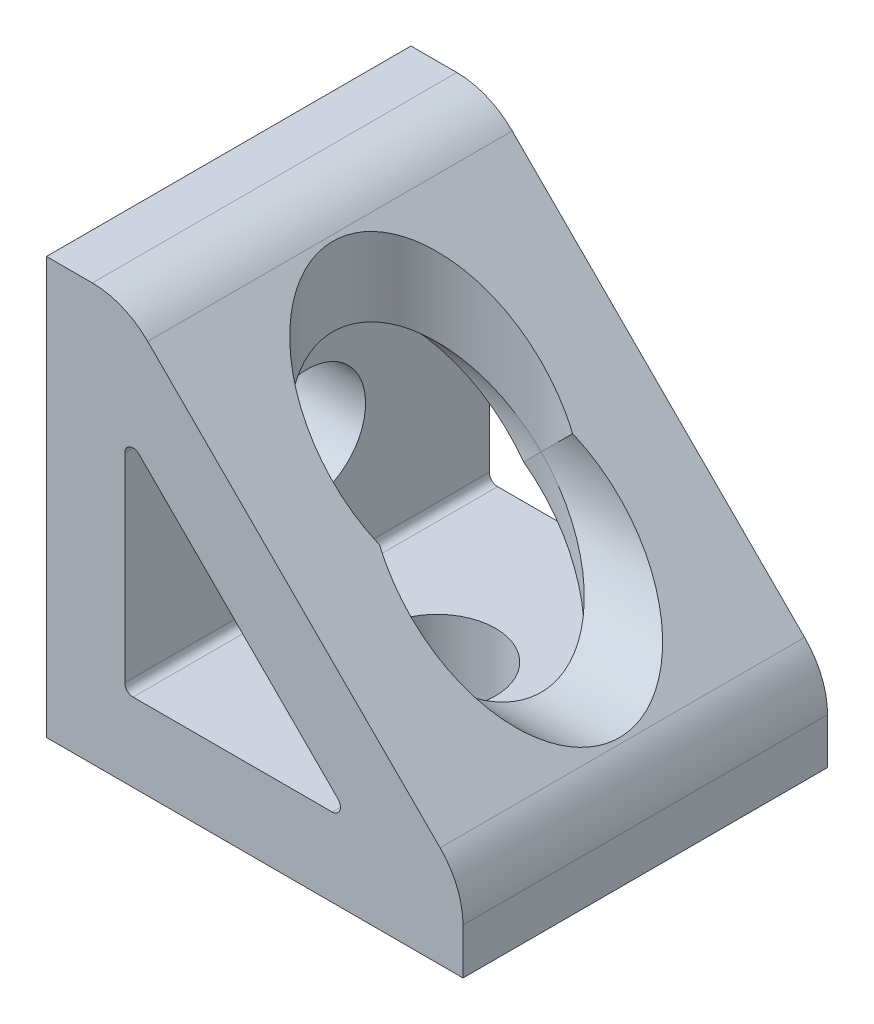
ISO-10303-21;
HEADER;
FILE_DESCRIPTION(('STEP AP214'),'2;1');
FILE_NAME('part.step','',(''),(''),'','','');
FILE_SCHEMA(('AUTOMOTIVE_DESIGN { 1 0 10303 214 1 1 1 1 }'));
ENDSEC;
DATA;
#1=APPLICATION_CONTEXT('core data for automotive mechanical design processes');
#2=APPLICATION_PROTOCOL_DEFINITION('international standard','automotive_design',2000,#1);
#3=PRODUCT_CONTEXT('',#1,'mechanical');
#4=PRODUCT('Part','Part','',(#3));
#5=PRODUCT_RELATED_PRODUCT_CATEGORY('part','',(#4));
#6=PRODUCT_DEFINITION_FORMATION('','',#4);
#7=PRODUCT_DEFINITION_CONTEXT('part definition',#1,'design');
#8=PRODUCT_DEFINITION('design','',#6,#7);
#9=PRODUCT_DEFINITION_SHAPE('','',#8);
#10=(LENGTH_UNIT() NAMED_UNIT(*) SI_UNIT(.MILLI.,.METRE.));
#11=(NAMED_UNIT(*) PLANE_ANGLE_UNIT() SI_UNIT($,.RADIAN.));
#12=(NAMED_UNIT(*) SI_UNIT($,.STERADIAN.) SOLID_ANGLE_UNIT());
#13=UNCERTAINTY_MEASURE_WITH_UNIT(LENGTH_MEASURE(1.E-05),#10,'distance_accuracy_value','');
#14=(GEOMETRIC_REPRESENTATION_CONTEXT(3) GLOBAL_UNCERTAINTY_ASSIGNED_CONTEXT((#13)) GLOBAL_UNIT_ASSIGNED_CONTEXT((#10,
#11,#12)) REPRESENTATION_CONTEXT('',''));
#15=CARTESIAN_POINT('',(0.,0.,0.));
#16=DIRECTION('',(0.,0.,1.));
#17=DIRECTION('',(1.,0.,0.));
#18=AXIS2_PLACEMENT_3D('',#15,#16,#17);
#19=CARTESIAN_POINT('',(12.7,25.4,0.));
#20=DIRECTION('',(0.,-1.,0.));
#21=DIRECTION('',(0.,0.,-1.));
#22=AXIS2_PLACEMENT_3D('',#19,#20,#21);
#23=CYLINDRICAL_SURFACE('',#22,6.35);
#24=CARTESIAN_POINT('',(12.7,17.4752,0.));
#25=DIRECTION('',(-0.707106781186548,-0.707106781186548,0.));
#26=DIRECTION('',(0.707106781186548,-0.707106781186548,0.));
#27=AXIS2_PLACEMENT_3D('',#24,#25,#26);
#28=ELLIPSE('',#27,8.98025612106915,6.35);
#29=CARTESIAN_POINT('',(15.0876,15.0876,-5.88403486053576));
#30=VERTEX_POINT('',#29);
#31=CARTESIAN_POINT('',(15.0876,15.0876,5.88403486053576));
#32=VERTEX_POINT('',#31);
#33=EDGE_CURVE('E384',#30,#32,#28,.F.);
#34=ORIENTED_EDGE('',*,*,#33,.T.);
#35=CARTESIAN_POINT('',(12.7,12.7,0.));
#36=DIRECTION('',(0.707106781186548,-0.707106781186547,0.));
#37=DIRECTION('',(-0.707106781186547,-0.707106781186548,0.));
#38=AXIS2_PLACEMENT_3D('',#35,#36,#37);
#39=ELLIPSE('',#38,8.98025612106915,6.35);
#40=CARTESIAN_POINT('',(12.7,12.7,6.35));
#41=VERTEX_POINT('',#40);
#42=EDGE_CURVE('E182',#32,#41,#39,.T.);
#43=ORIENTED_EDGE('',*,*,#42,.T.);
#44=CARTESIAN_POINT('',(12.7,12.7,0.));
#45=DIRECTION('',(-0.707106781186547,-0.707106781186548,0.));
#46=DIRECTION('',(0.707106781186548,-0.707106781186547,0.));
#47=AXIS2_PLACEMENT_3D('',#44,#45,#46);
#48=ELLIPSE('',#47,8.98025612106915,6.35);
#49=CARTESIAN_POINT('',(12.7,12.7,-6.35));
#50=VERTEX_POINT('',#49);
#51=EDGE_CURVE('E168',#41,#50,#48,.T.);
#52=ORIENTED_EDGE('',*,*,#51,.T.);
#53=CARTESIAN_POINT('',(12.7,12.7,0.));
#54=DIRECTION('',(-0.707106781186548,0.707106781186547,0.));
#55=DIRECTION('',(-0.707106781186547,-0.707106781186548,0.));
#56=AXIS2_PLACEMENT_3D('',#53,#54,#55);
#57=ELLIPSE('',#56,8.98025612106915,6.35);
#58=EDGE_CURVE('E174',#30,#50,#57,.T.);
#59=ORIENTED_EDGE('',*,*,#58,.F.);
#60=EDGE_LOOP('',(#34,#43,#52,#59));
#61=FACE_BOUND('',#60,.T.);
#62=ADVANCED_FACE('F17',(#61),#23,.F.);
#63=CARTESIAN_POINT('',(25.4,12.7,0.));
#64=DIRECTION('',(-1.,0.,0.));
#65=DIRECTION('',(0.,-1.,0.));
#66=AXIS2_PLACEMENT_3D('',#63,#64,#65);
#67=CYLINDRICAL_SURFACE('',#66,6.35);
#68=CARTESIAN_POINT('',(17.4752,12.7,0.));
#69=DIRECTION('',(-0.707106781186548,-0.707106781186548,0.));
#70=DIRECTION('',(-0.707106781186548,0.707106781186548,0.));
#71=AXIS2_PLACEMENT_3D('',#68,#69,#70);
#72=ELLIPSE('',#71,8.98025612106915,6.35);
#73=EDGE_CURVE('E177',#32,#30,#72,.F.);
#74=ORIENTED_EDGE('',*,*,#73,.T.);
#75=ORIENTED_EDGE('',*,*,#58,.T.);
#76=CARTESIAN_POINT('',(12.7,12.7,0.));
#77=DIRECTION('',(-0.707106781186547,-0.707106781186548,0.));
#78=DIRECTION('',(-0.707106781186548,0.707106781186547,0.));
#79=AXIS2_PLACEMENT_3D('',#76,#77,#78);
#80=ELLIPSE('',#79,8.98025612106915,6.35);
#81=EDGE_CURVE('E151',#50,#41,#80,.T.);
#82=ORIENTED_EDGE('',*,*,#81,.T.);
#83=ORIENTED_EDGE('',*,*,#42,.F.);
#84=EDGE_LOOP('',(#74,#75,#82,#83));
#85=FACE_BOUND('',#84,.T.);
#86=ADVANCED_FACE('F175',(#85),#67,.F.);
#87=CARTESIAN_POINT('',(17.4204269072705,5.2832,11.1125));
#88=DIRECTION('',(0.,0.,-1.));
#89=DIRECTION('',(-1.,0.,0.));
#90=AXIS2_PLACEMENT_3D('',#87,#88,#89);
#91=CYLINDRICAL_SURFACE('',#90,0.507999999999998);
#92=CARTESIAN_POINT('',(17.7796371521132,5.64241024484277,3.81048374919394));
#93=CARTESIAN_POINT('',(17.7883333124472,5.63370856311354,3.79889138080289));
#94=CARTESIAN_POINT('',(17.7968318828416,5.62458349521479,3.78747906709042));
#95=CARTESIAN_POINT('',(17.8133986981704,5.60537916131748,3.76508284849013));
#96=CARTESIAN_POINT('',(17.8214656298365,5.59529721644453,3.75410027562521));
#97=CARTESIAN_POINT('',(17.845116428317,5.56322842926829,3.72169206560348));
#98=CARTESIAN_POINT('',(17.8598958230457,5.53966448295931,3.70114636974854));
#99=CARTESIAN_POINT('',(17.8810924886656,5.49805620283357,3.67137249799756));
#100=CARTESIAN_POINT('',(17.8885219657932,5.48144766364685,3.66085708987994));
#101=CARTESIAN_POINT('',(17.9018070766133,5.44654991824729,3.64195486288475));
#102=CARTESIAN_POINT('',(17.9076700681061,5.42826913070793,3.63355810342968));
#103=CARTESIAN_POINT('',(17.9166075365671,5.39336530960493,3.62071223652807));
#104=CARTESIAN_POINT('',(17.9199849010382,5.37697915115832,3.61583705936111));
#105=CARTESIAN_POINT('',(17.9251279628338,5.34343306471349,3.60840111990062));
#106=CARTESIAN_POINT('',(17.9268941679798,5.3262733823132,3.60583962835855));
#107=CARTESIAN_POINT('',(17.9286548266346,5.29160179665178,3.60328620101482));
#108=CARTESIAN_POINT('',(17.9286425196726,5.27408880245012,3.60330406986407));
#109=CARTESIAN_POINT('',(17.9268301762173,5.23935342325999,3.60593241684237));
#110=CARTESIAN_POINT('',(17.9250295700926,5.22213113264778,3.60854372106509));
#111=CARTESIAN_POINT('',(17.9199552088587,5.18942107284772,3.61587965499263));
#112=CARTESIAN_POINT('',(17.9167695871463,5.17389017844441,3.62047776327796));
#113=CARTESIAN_POINT('',(17.9091675862811,5.14377949301812,3.63140709900997));
#114=CARTESIAN_POINT('',(17.9047507311679,5.12920007250359,3.63773899667438));
#115=CARTESIAN_POINT('',(17.8918125900947,5.09229033092581,3.65619671030874));
#116=CARTESIAN_POINT('',(17.8824535417514,5.07082680530542,3.66946707518853));
#117=CARTESIAN_POINT('',(17.8617960798292,5.03067317538378,3.69847020640858));
#118=CARTESIAN_POINT('',(17.8504919154002,5.01199161069783,3.71421026201154));
#119=CARTESIAN_POINT('',(17.8191201500256,4.96654401619267,3.75741714079145));
#120=CARTESIAN_POINT('',(17.7979147534765,4.94180261343145,3.78617800705458));
#121=CARTESIAN_POINT('',(17.753003271266,4.89791670491141,3.84591628870004));
#122=CARTESIAN_POINT('',(17.7292906766661,4.87878727910359,3.87689940277821));
#123=CARTESIAN_POINT('',(17.6686922203378,4.83787692204293,3.95449037561444));
#124=CARTESIAN_POINT('',(17.630748506309,4.81889679757743,4.00175305373392));
#125=CARTESIAN_POINT('',(17.5521217993657,4.79080014757748,4.09673128578227));
#126=CARTESIAN_POINT('',(17.5114440480836,4.78166528938716,4.14444583051086));
#127=CARTESIAN_POINT('',(17.4535207465419,4.77601780812482,4.210364646228));
#128=CARTESIAN_POINT('',(17.4370271200594,4.77520995303944,4.22891486166735));
#129=CARTESIAN_POINT('',(17.4204269072705,4.7752,4.24736033473935));
#130=B_SPLINE_CURVE_WITH_KNOTS('',3,(#92,#93,#94,#95,#96,#97,#98,#99,#100,#101,#102,#103,#104,
#105,#106,#107,#108,#109,#110,#111,#112,#113,#114,#115,#116,#117,#118,#119,#120,#121,#122,#123,
#124,#125,#126,#127,#128,#129),.UNSPECIFIED.,.F.,.F.,(4,2,2,2,2,2,2,2,2,2,2,2,2,2,2,2,2,2,4),
(0.,0.0506837306520263,0.101513794219076,0.204635683435221,0.267505038050829,0.330073685533628,
0.382138884926963,0.434187668203855,0.486434304227522,0.538697587846183,0.588034428624639,
0.637390368159527,0.717669114407369,0.798189421008752,0.927853058393364,1.05786198911492,
1.24743713587404,1.43665866572774,1.51111326173056),.UNSPECIFIED.);
#131=CARTESIAN_POINT('',(17.7796371521132,5.64241024484277,3.81048374919394));
#132=VERTEX_POINT('',#131);
#133=CARTESIAN_POINT('',(17.4204269072705,4.7752,4.24736033473935));
#134=VERTEX_POINT('',#133);
#135=EDGE_CURVE('E163',#132,#134,#130,.T.);
#136=ORIENTED_EDGE('',*,*,#135,.T.);
#137=DIRECTION('',(0.,0.,1.));
#138=VECTOR('',#137,1.);
#139=CARTESIAN_POINT('',(17.4204269072705,4.7752,11.1125));
#140=LINE('',#139,#138);
#141=CARTESIAN_POINT('',(17.4204269072705,4.7752,11.1125));
#142=VERTEX_POINT('',#141);
#143=EDGE_CURVE('E380',#142,#134,#140,.F.);
#144=ORIENTED_EDGE('',*,*,#143,.F.);
#145=CARTESIAN_POINT('',(17.4204269072705,5.2832,11.1125));
#146=DIRECTION('',(0.,0.,-1.));
#147=DIRECTION('',(-1.,0.,0.));
#148=AXIS2_PLACEMENT_3D('',#145,#146,#147);
#149=CIRCLE('',#148,0.507999999999998);
#150=CARTESIAN_POINT('',(17.7796371521132,5.64241024484277,11.1125));
#151=VERTEX_POINT('',#150);
#152=EDGE_CURVE('E503',#151,#142,#149,.T.);
#153=ORIENTED_EDGE('',*,*,#152,.F.);
#154=DIRECTION('',(0.,0.,1.));
#155=VECTOR('',#154,1.);
#156=CARTESIAN_POINT('',(17.7796371521132,5.64241024484277,11.1125));
#157=LINE('',#156,#155);
#158=EDGE_CURVE('E390',#132,#151,#157,.T.);
#159=ORIENTED_EDGE('',*,*,#158,.F.);
#160=EDGE_LOOP('',(#136,#144,#153,#159));
#161=FACE_BOUND('',#160,.T.);
#162=ADVANCED_FACE('F527',(#161),#91,.F.);
#163=CARTESIAN_POINT('',(5.2832,17.4204269072705,11.1125));
#164=DIRECTION('',(0.,0.,-1.));
#165=DIRECTION('',(-1.,0.,0.));
#166=AXIS2_PLACEMENT_3D('',#163,#164,#165);
#167=CYLINDRICAL_SURFACE('',#166,0.508);
#168=CARTESIAN_POINT('',(4.7752,17.4204269072704,4.24736033473935));
#169=CARTESIAN_POINT('',(4.77521046724601,17.4420924856764,4.22328508045935));
#170=CARTESIAN_POINT('',(4.77658605471394,17.4635662308095,4.19904582709387));
#171=CARTESIAN_POINT('',(4.78200159472634,17.5060131520486,4.15039429932005));
#172=CARTESIAN_POINT('',(4.78604351709437,17.5269859461851,4.12598191020381));
#173=CARTESIAN_POINT('',(4.79678199208576,17.5684994852333,4.07691772352855));
#174=CARTESIAN_POINT('',(4.80350610470041,17.5890333365038,4.05226611774794));
#175=CARTESIAN_POINT('',(4.81961765940842,17.6292935812707,4.00319516862432));
#176=CARTESIAN_POINT('',(4.82900389569489,17.6490203357225,3.97877572528728));
#177=CARTESIAN_POINT('',(4.85455357115968,17.6947394093427,3.92133656460339));
#178=CARTESIAN_POINT('',(4.87193874939082,17.7203148602738,3.88851705199913));
#179=CARTESIAN_POINT('',(4.91237240067932,17.7690703949101,3.82473811417215));
#180=CARTESIAN_POINT('',(4.9354004825951,17.7922586856149,3.79377248031576));
#181=CARTESIAN_POINT('',(4.97791824667546,17.8270004785444,3.74658101072067));
#182=CARTESIAN_POINT('',(4.99535181365528,17.8395940700084,3.72927348245638));
#183=CARTESIAN_POINT('',(5.03302106404657,17.863108232783,3.69664903722876));
#184=CARTESIAN_POINT('',(5.05325324857269,17.8740308578064,3.68132968026151));
#185=CARTESIAN_POINT('',(5.09114655378691,17.8910574220427,3.65726436442134));
#186=CARTESIAN_POINT('',(5.10813847665273,17.8976789749363,3.64783982251966));
#187=CARTESIAN_POINT('',(5.14373439367388,17.9092642191962,3.63127642560542));
#188=CARTESIAN_POINT('',(5.16233579994144,17.9142305118781,3.62413398490661));
#189=CARTESIAN_POINT('',(5.19743703216341,17.9213962914119,3.61380042328051));
#190=CARTESIAN_POINT('',(5.21372677322737,17.9239297564496,3.61013390639403));
#191=CARTESIAN_POINT('',(5.24682501316101,17.9273953129222,3.60511413516427));
#192=CARTESIAN_POINT('',(5.26363309486034,17.9283286596024,3.6037590675622));
#193=CARTESIAN_POINT('',(5.29730447707779,17.9285104709857,3.60349529156194));
#194=CARTESIAN_POINT('',(5.31416782281174,17.927756317429,3.60459038473776));
#195=CARTESIAN_POINT('',(5.3474214082833,17.9246285205018,3.60912233530311));
#196=CARTESIAN_POINT('',(5.36381132370793,17.9222537931886,3.61256076005944));
#197=CARTESIAN_POINT('',(5.39943025782155,17.9153565231575,3.62251299486325));
#198=CARTESIAN_POINT('',(5.41843841204279,17.9104640845815,3.62955440383875));
#199=CARTESIAN_POINT('',(5.4548178207322,17.89894290879,3.64603808381968));
#200=CARTESIAN_POINT('',(5.47218546922247,17.892310462367,3.65548548244433));
#201=CARTESIAN_POINT('',(5.51333857652347,17.8741082748739,3.68123036161128));
#202=CARTESIAN_POINT('',(5.53607437061717,17.8617153299734,3.69861048602099));
#203=CARTESIAN_POINT('',(5.57802257558475,17.834874461339,3.7357851633193));
#204=CARTESIAN_POINT('',(5.59723052062932,17.8204239735057,3.75558272435373));
#205=CARTESIAN_POINT('',(5.62450634899135,17.7969006642059,3.78738763194976));
#206=CARTESIAN_POINT('',(5.63367579047622,17.7883611270019,3.79885605078555));
#207=CARTESIAN_POINT('',(5.64241024484278,17.7796371521132,3.81048374919394));
#208=B_SPLINE_CURVE_WITH_KNOTS('',3,(#168,#169,#170,#171,#172,#173,#174,#175,#176,#177,#178,
#179,#180,#181,#182,#183,#184,#185,#186,#187,#188,#189,#190,#191,#192,#193,#194,#195,#196,#197,
#198,#199,#200,#201,#202,#203,#204,#205,#206,#207),.UNSPECIFIED.,.F.,.F.,(4,2,2,2,2,2,2,2,2,2,2,
2,2,2,2,2,2,2,2,4),(0.,0.0971267833027569,0.194325401998055,0.292549599213744,0.390729376712899,
0.525638679797282,0.66006748478254,0.742693286989565,0.825216707102879,0.886598734818593,
0.947883838018685,0.998331037145106,1.0487386438098,1.09922451518082,1.14974418784643,
1.21195644571509,1.27430241571198,1.36734096694783,1.46049649396306,1.511404348917),.UNSPECIFIED.);
#209=CARTESIAN_POINT('',(4.7752,17.4204269072704,4.24736033473935));
#210=VERTEX_POINT('',#209);
#211=CARTESIAN_POINT('',(5.64241024484278,17.7796371521132,3.81048374919394));
#212=VERTEX_POINT('',#211);
#213=EDGE_CURVE('E162',#210,#212,#208,.T.);
#214=ORIENTED_EDGE('',*,*,#213,.T.);
#215=DIRECTION('',(0.,0.,1.));
#216=VECTOR('',#215,1.);
#217=CARTESIAN_POINT('',(5.64241024484278,17.7796371521132,11.1125));
#218=LINE('',#217,#216);
#219=CARTESIAN_POINT('',(5.64241024484277,17.7796371521132,11.1125));
#220=VERTEX_POINT('',#219);
#221=EDGE_CURVE('E233',#220,#212,#218,.F.);
#222=ORIENTED_EDGE('',*,*,#221,.F.);
#223=CARTESIAN_POINT('',(5.2832,17.4204269072705,11.1125));
#224=DIRECTION('',(0.,0.,-1.));
#225=DIRECTION('',(-1.,0.,0.));
#226=AXIS2_PLACEMENT_3D('',#223,#224,#225);
#227=CIRCLE('',#226,0.508);
#228=CARTESIAN_POINT('',(4.7752,17.4204269072705,11.1125));
#229=VERTEX_POINT('',#228);
#230=EDGE_CURVE('E500',#229,#220,#227,.T.);
#231=ORIENTED_EDGE('',*,*,#230,.F.);
#232=DIRECTION('',(0.,0.,1.));
#233=VECTOR('',#232,1.);
#234=CARTESIAN_POINT('',(4.7752,17.4204269072704,11.1125));
#235=LINE('',#234,#233);
#236=EDGE_CURVE('E374',#210,#229,#235,.T.);
#237=ORIENTED_EDGE('',*,*,#236,.F.);
#238=EDGE_LOOP('',(#214,#222,#231,#237));
#239=FACE_BOUND('',#238,.T.);
#240=ADVANCED_FACE('F203',(#239),#167,.F.);
#241=CARTESIAN_POINT('',(5.2832,5.2832,11.1125));
#242=DIRECTION('',(0.,0.,-1.));
#243=DIRECTION('',(-1.,0.,0.));
#244=AXIS2_PLACEMENT_3D('',#241,#242,#243);
#245=CYLINDRICAL_SURFACE('',#244,0.508);
#246=DIRECTION('',(0.,0.,1.));
#247=VECTOR('',#246,1.);
#248=CARTESIAN_POINT('',(4.7752,5.2832,11.1125));
#249=LINE('',#248,#247);
#250=CARTESIAN_POINT('',(4.7752,5.2832,11.1125));
#251=VERTEX_POINT('',#250);
#252=CARTESIAN_POINT('',(4.7752,5.2832,-11.1125));
#253=VERTEX_POINT('',#252);
#254=EDGE_CURVE('E369',#251,#253,#249,.F.);
#255=ORIENTED_EDGE('',*,*,#254,.F.);
#256=CARTESIAN_POINT('',(5.2832,5.2832,11.1125));
#257=DIRECTION('',(0.,0.,-1.));
#258=DIRECTION('',(-1.,0.,0.));
#259=AXIS2_PLACEMENT_3D('',#256,#257,#258);
#260=CIRCLE('',#259,0.508);
#261=CARTESIAN_POINT('',(5.2832,4.7752,11.1125));
#262=VERTEX_POINT('',#261);
#263=EDGE_CURVE('E502',#262,#251,#260,.T.);
#264=ORIENTED_EDGE('',*,*,#263,.F.);
#265=DIRECTION('',(0.,0.,1.));
#266=VECTOR('',#265,1.);
#267=CARTESIAN_POINT('',(5.28320000000001,4.7752,11.1125));
#268=LINE('',#267,#266);
#269=CARTESIAN_POINT('',(5.2832,4.7752,-11.1125));
#270=VERTEX_POINT('',#269);
#271=EDGE_CURVE('E433',#270,#262,#268,.T.);
#272=ORIENTED_EDGE('',*,*,#271,.F.);
#273=CARTESIAN_POINT('',(5.2832,5.2832,-11.1125));
#274=DIRECTION('',(0.,0.,-1.));
#275=DIRECTION('',(-1.,0.,0.));
#276=AXIS2_PLACEMENT_3D('',#273,#274,#275);
#277=CIRCLE('',#276,0.508);
#278=EDGE_CURVE('E494',#253,#270,#277,.F.);
#279=ORIENTED_EDGE('',*,*,#278,.F.);
#280=EDGE_LOOP('',(#255,#264,#272,#279));
#281=FACE_BOUND('',#280,.T.);
#282=ADVANCED_FACE('F616',(#281),#245,.F.);
#283=CARTESIAN_POINT('',(12.7,25.4,0.));
#284=DIRECTION('',(0.,-1.,0.));
#285=DIRECTION('',(0.,0.,-1.));
#286=AXIS2_PLACEMENT_3D('',#283,#284,#285);
#287=CYLINDRICAL_SURFACE('',#286,6.35);
#288=ORIENTED_EDGE('',*,*,#81,.F.);
#289=CARTESIAN_POINT('',(12.7,12.7,0.));
#290=DIRECTION('',(-0.707106781186548,0.707106781186547,0.));
#291=DIRECTION('',(-0.707106781186547,-0.707106781186548,0.));
#292=AXIS2_PLACEMENT_3D('',#289,#290,#291);
#293=ELLIPSE('',#292,8.98025612106915,6.35);
#294=CARTESIAN_POINT('',(11.711023698478,11.711023698478,-6.27251352131088));
#295=VERTEX_POINT('',#294);
#296=EDGE_CURVE('E20',#295,#50,#293,.F.);
#297=ORIENTED_EDGE('',*,*,#296,.F.);
#298=CARTESIAN_POINT('',(12.7,10.722047396956,0.));
#299=DIRECTION('',(-0.707106781186547,-0.707106781186548,0.));
#300=DIRECTION('',(0.707106781186548,-0.707106781186547,0.));
#301=AXIS2_PLACEMENT_3D('',#298,#299,#300);
#302=ELLIPSE('',#301,8.98025612106915,6.35);
#303=CARTESIAN_POINT('',(17.7796371521132,5.64241024484277,-3.81048374919394));
#304=VERTEX_POINT('',#303);
#305=EDGE_CURVE('E361',#304,#295,#302,.F.);
#306=ORIENTED_EDGE('',*,*,#305,.F.);
#307=CARTESIAN_POINT('',(17.7796371521132,5.64241024484277,-3.81048374919394));
#308=CARTESIAN_POINT('',(17.7883333124472,5.63370856311354,-3.79889138080289));
#309=CARTESIAN_POINT('',(17.7968318828416,5.62458349521479,-3.78747906709042));
#310=CARTESIAN_POINT('',(17.8133986981704,5.60537916131748,-3.76508284849013));
#311=CARTESIAN_POINT('',(17.8214656298365,5.59529721644453,-3.75410027562521));
#312=CARTESIAN_POINT('',(17.845116428317,5.56322842926829,-3.72169206560348));
#313=CARTESIAN_POINT('',(17.8598958230457,5.53966448295931,-3.70114636974854));
#314=CARTESIAN_POINT('',(17.8810924886656,5.49805620283357,-3.67137249799756));
#315=CARTESIAN_POINT('',(17.8885219657932,5.48144766364685,-3.66085708987994));
#316=CARTESIAN_POINT('',(17.9018070766133,5.44654991824729,-3.64195486288475));
#317=CARTESIAN_POINT('',(17.9076700681061,5.42826913070793,-3.63355810342969));
#318=CARTESIAN_POINT('',(17.9166075365671,5.39336530960493,-3.62071223652807));
#319=CARTESIAN_POINT('',(17.9199849010382,5.37697915115832,-3.61583705936111));
#320=CARTESIAN_POINT('',(17.9251279628338,5.34343306471349,-3.60840111990062));
#321=CARTESIAN_POINT('',(17.9268941679798,5.3262733823132,-3.60583962835855));
#322=CARTESIAN_POINT('',(17.9286548266346,5.29160179665178,-3.60328620101482));
#323=CARTESIAN_POINT('',(17.9286425196726,5.27408880245012,-3.60330406986407));
#324=CARTESIAN_POINT('',(17.9268301762173,5.23935342325998,-3.60593241684237));
#325=CARTESIAN_POINT('',(17.9250295700926,5.22213113264778,-3.60854372106509));
#326=CARTESIAN_POINT('',(17.9199552088587,5.18942107284772,-3.61587965499263));
#327=CARTESIAN_POINT('',(17.9167695871463,5.17389017844441,-3.62047776327796));
#328=CARTESIAN_POINT('',(17.9091675862811,5.14377949301812,-3.63140709900997));
#329=CARTESIAN_POINT('',(17.9047507311679,5.12920007250359,-3.63773899667438));
#330=CARTESIAN_POINT('',(17.8918125900947,5.0922903309258,-3.65619671030875));
#331=CARTESIAN_POINT('',(17.8824535417514,5.07082680530542,-3.66946707518853));
#332=CARTESIAN_POINT('',(17.8617960798292,5.03067317538378,-3.69847020640858));
#333=CARTESIAN_POINT('',(17.8504919154002,5.01199161069783,-3.71421026201154));
#334=CARTESIAN_POINT('',(17.8191201500256,4.96654401619267,-3.75741714079145));
#335=CARTESIAN_POINT('',(17.7979147534765,4.94180261343145,-3.78617800705458));
#336=CARTESIAN_POINT('',(17.753003271266,4.89791670491141,-3.84591628870004));
#337=CARTESIAN_POINT('',(17.7292906766661,4.87878727910359,-3.87689940277821));
#338=CARTESIAN_POINT('',(17.6686922203378,4.83787692204293,-3.95449037561444));
#339=CARTESIAN_POINT('',(17.630748506309,4.81889679757743,-4.00175305373391));
#340=CARTESIAN_POINT('',(17.5521217993657,4.79080014757748,-4.09673128578227));
#341=CARTESIAN_POINT('',(17.5114440480836,4.78166528938716,-4.14444583051086));
#342=CARTESIAN_POINT('',(17.4535207465419,4.77601780812482,-4.21036464622799));
#343=CARTESIAN_POINT('',(17.4370271200594,4.77520995303944,-4.22891486166735));
#344=CARTESIAN_POINT('',(17.4204269072705,4.7752,-4.24736033473935));
#345=B_SPLINE_CURVE_WITH_KNOTS('',3,(#307,#308,#309,#310,#311,#312,#313,#314,#315,#316,#317,
#318,#319,#320,#321,#322,#323,#324,#325,#326,#327,#328,#329,#330,#331,#332,#333,#334,#335,#336,
#337,#338,#339,#340,#341,#342,#343,#344),.UNSPECIFIED.,.F.,.F.,(4,2,2,2,2,2,2,2,2,2,2,2,2,2,2,2,
2,2,4),(0.,0.050683730652025,0.101513794219074,0.204635683435221,0.267505038050827,
0.330073685533626,0.382138884926962,0.434187668203854,0.486434304227523,0.538697587846184,
0.58803442862464,0.637390368159529,0.717669114407369,0.798189421008751,0.927853058393362,
1.05786198911491,1.24743713587404,1.43665866572773,1.51111326173056),.UNSPECIFIED.);
#346=CARTESIAN_POINT('',(17.4204269072705,4.7752,-4.24736033473934));
#347=VERTEX_POINT('',#346);
#348=EDGE_CURVE('E225',#304,#347,#345,.T.);
#349=ORIENTED_EDGE('',*,*,#348,.T.);
#350=CARTESIAN_POINT('',(12.7,4.7752,0.));
#351=DIRECTION('',(0.,-1.,0.));
#352=DIRECTION('',(0.,0.,-1.));
#353=AXIS2_PLACEMENT_3D('',#350,#351,#352);
#354=CIRCLE('',#353,6.35);
#355=EDGE_CURVE('E376',#134,#347,#354,.F.);
#356=ORIENTED_EDGE('',*,*,#355,.F.);
#357=ORIENTED_EDGE('',*,*,#135,.F.);
#358=CARTESIAN_POINT('',(12.7,10.722047396956,0.));
#359=DIRECTION('',(-0.707106781186547,-0.707106781186548,0.));
#360=DIRECTION('',(0.707106781186548,-0.707106781186547,0.));
#361=AXIS2_PLACEMENT_3D('',#358,#359,#360);
#362=ELLIPSE('',#361,8.98025612106915,6.35);
#363=CARTESIAN_POINT('',(11.711023698478,11.711023698478,6.27251352131088));
#364=VERTEX_POINT('',#363);
#365=EDGE_CURVE('E387',#364,#132,#362,.F.);
#366=ORIENTED_EDGE('',*,*,#365,.F.);
#367=CARTESIAN_POINT('',(12.7,12.7,0.));
#368=DIRECTION('',(-0.707106781186548,0.707106781186547,0.));
#369=DIRECTION('',(-0.707106781186547,-0.707106781186548,0.));
#370=AXIS2_PLACEMENT_3D('',#367,#368,#369);
#371=ELLIPSE('',#370,8.98025612106915,6.35);
#372=EDGE_CURVE('E157',#41,#364,#371,.F.);
#373=ORIENTED_EDGE('',*,*,#372,.F.);
#374=EDGE_LOOP('',(#288,#297,#306,#349,#356,#357,#366,#373));
#375=FACE_BOUND('',#374,.T.);
#376=ADVANCED_FACE('F153',(#375),#287,.F.);
#377=CARTESIAN_POINT('',(25.4,12.7,0.));
#378=DIRECTION('',(-1.,0.,0.));
#379=DIRECTION('',(0.,-1.,0.));
#380=AXIS2_PLACEMENT_3D('',#377,#378,#379);
#381=CYLINDRICAL_SURFACE('',#380,6.35);
#382=ORIENTED_EDGE('',*,*,#296,.T.);
#383=ORIENTED_EDGE('',*,*,#51,.F.);
#384=ORIENTED_EDGE('',*,*,#372,.T.);
#385=CARTESIAN_POINT('',(10.722047396956,12.7,0.));
#386=DIRECTION('',(-0.707106781186547,-0.707106781186548,0.));
#387=DIRECTION('',(-0.707106781186548,0.707106781186547,0.));
#388=AXIS2_PLACEMENT_3D('',#385,#386,#387);
#389=ELLIPSE('',#388,8.98025612106915,6.35);
#390=EDGE_CURVE('E234',#212,#364,#389,.F.);
#391=ORIENTED_EDGE('',*,*,#390,.F.);
#392=ORIENTED_EDGE('',*,*,#213,.F.);
#393=CARTESIAN_POINT('',(4.7752,12.7,0.));
#394=DIRECTION('',(-1.,0.,0.));
#395=DIRECTION('',(0.,-1.,0.));
#396=AXIS2_PLACEMENT_3D('',#393,#394,#395);
#397=CIRCLE('',#396,6.35);
#398=CARTESIAN_POINT('',(4.7752,17.4204269072704,-4.24736033473935));
#399=VERTEX_POINT('',#398);
#400=EDGE_CURVE('E370',#399,#210,#397,.F.);
#401=ORIENTED_EDGE('',*,*,#400,.F.);
#402=CARTESIAN_POINT('',(4.7752,17.4204269072704,-4.24736033473935));
#403=CARTESIAN_POINT('',(4.77521046724601,17.4420924856764,-4.22328508045935));
#404=CARTESIAN_POINT('',(4.77658605471394,17.4635662308095,-4.19904582709387));
#405=CARTESIAN_POINT('',(4.78200159472634,17.5060131520486,-4.15039429932005));
#406=CARTESIAN_POINT('',(4.78604351709437,17.5269859461851,-4.12598191020381));
#407=CARTESIAN_POINT('',(4.79678199208576,17.5684994852333,-4.07691772352855));
#408=CARTESIAN_POINT('',(4.80350610470041,17.5890333365038,-4.05226611774794));
#409=CARTESIAN_POINT('',(4.81961765940842,17.6292935812707,-4.00319516862432));
#410=CARTESIAN_POINT('',(4.82900389569489,17.6490203357225,-3.97877572528728));
#411=CARTESIAN_POINT('',(4.85455357115968,17.6947394093427,-3.92133656460339));
#412=CARTESIAN_POINT('',(4.87193874939082,17.7203148602738,-3.88851705199913));
#413=CARTESIAN_POINT('',(4.91237240067932,17.7690703949101,-3.82473811417215));
#414=CARTESIAN_POINT('',(4.9354004825951,17.7922586856149,-3.79377248031576));
#415=CARTESIAN_POINT('',(4.97791824667546,17.8270004785444,-3.74658101072067));
#416=CARTESIAN_POINT('',(4.99535181365528,17.8395940700084,-3.72927348245638));
#417=CARTESIAN_POINT('',(5.03302106404657,17.863108232783,-3.69664903722876));
#418=CARTESIAN_POINT('',(5.05325324857269,17.8740308578064,-3.68132968026151));
#419=CARTESIAN_POINT('',(5.09114655378691,17.8910574220427,-3.65726436442134));
#420=CARTESIAN_POINT('',(5.10813847665273,17.8976789749363,-3.64783982251966));
#421=CARTESIAN_POINT('',(5.14373439367388,17.9092642191962,-3.63127642560542));
#422=CARTESIAN_POINT('',(5.16233579994144,17.9142305118781,-3.62413398490661));
#423=CARTESIAN_POINT('',(5.19743703216341,17.9213962914119,-3.61380042328051));
#424=CARTESIAN_POINT('',(5.21372677322737,17.9239297564496,-3.61013390639403));
#425=CARTESIAN_POINT('',(5.24682501316101,17.9273953129222,-3.60511413516427));
#426=CARTESIAN_POINT('',(5.26363309486034,17.9283286596024,-3.6037590675622));
#427=CARTESIAN_POINT('',(5.29730447707779,17.9285104709857,-3.60349529156194));
#428=CARTESIAN_POINT('',(5.31416782281174,17.927756317429,-3.60459038473776));
#429=CARTESIAN_POINT('',(5.3474214082833,17.9246285205018,-3.60912233530311));
#430=CARTESIAN_POINT('',(5.36381132370793,17.9222537931886,-3.61256076005944));
#431=CARTESIAN_POINT('',(5.39943025782155,17.9153565231575,-3.62251299486325));
#432=CARTESIAN_POINT('',(5.41843841204279,17.9104640845815,-3.62955440383875));
#433=CARTESIAN_POINT('',(5.4548178207322,17.89894290879,-3.64603808381968));
#434=CARTESIAN_POINT('',(5.47218546922247,17.892310462367,-3.65548548244433));
#435=CARTESIAN_POINT('',(5.51333857652347,17.8741082748739,-3.68123036161128));
#436=CARTESIAN_POINT('',(5.53607437061717,17.8617153299734,-3.69861048602099));
#437=CARTESIAN_POINT('',(5.57802257558475,17.834874461339,-3.7357851633193));
#438=CARTESIAN_POINT('',(5.59723052062932,17.8204239735057,-3.75558272435373));
#439=CARTESIAN_POINT('',(5.62450634899135,17.7969006642059,-3.78738763194976));
#440=CARTESIAN_POINT('',(5.63367579047622,17.7883611270019,-3.79885605078555));
#441=CARTESIAN_POINT('',(5.64241024484278,17.7796371521132,-3.81048374919394));
#442=B_SPLINE_CURVE_WITH_KNOTS('',3,(#402,#403,#404,#405,#406,#407,#408,#409,#410,#411,#412,
#413,#414,#415,#416,#417,#418,#419,#420,#421,#422,#423,#424,#425,#426,#427,#428,#429,#430,#431,
#432,#433,#434,#435,#436,#437,#438,#439,#440,#441),.UNSPECIFIED.,.F.,.F.,(4,2,2,2,2,2,2,2,2,2,2,
2,2,2,2,2,2,2,2,4),(0.,0.0971267833027569,0.194325401998055,0.292549599213744,0.390729376712899,
0.525638679797282,0.66006748478254,0.742693286989565,0.825216707102879,0.886598734818593,
0.947883838018685,0.998331037145106,1.0487386438098,1.09922451518082,1.14974418784643,
1.21195644571509,1.27430241571198,1.36734096694783,1.46049649396306,1.511404348917),.UNSPECIFIED.);
#443=CARTESIAN_POINT('',(5.64241024484278,17.7796371521132,-3.81048374919394));
#444=VERTEX_POINT('',#443);
#445=EDGE_CURVE('E191',#399,#444,#442,.T.);
#446=ORIENTED_EDGE('',*,*,#445,.T.);
#447=CARTESIAN_POINT('',(10.722047396956,12.7,0.));
#448=DIRECTION('',(-0.707106781186547,-0.707106781186548,0.));
#449=DIRECTION('',(-0.707106781186548,0.707106781186547,0.));
#450=AXIS2_PLACEMENT_3D('',#447,#448,#449);
#451=ELLIPSE('',#450,8.98025612106915,6.35);
#452=EDGE_CURVE('E171',#295,#444,#451,.F.);
#453=ORIENTED_EDGE('',*,*,#452,.F.);
#454=EDGE_LOOP('',(#382,#383,#384,#391,#392,#401,#446,#453));
#455=FACE_BOUND('',#454,.T.);
#456=ADVANCED_FACE('F166',(#455),#381,.F.);
#457=CARTESIAN_POINT('',(5.2832,17.4204269072705,11.1125));
#458=DIRECTION('',(0.,0.,-1.));
#459=DIRECTION('',(-1.,0.,0.));
#460=AXIS2_PLACEMENT_3D('',#457,#458,#459);
#461=CYLINDRICAL_SURFACE('',#460,0.508);
#462=ORIENTED_EDGE('',*,*,#445,.F.);
#463=DIRECTION('',(0.,0.,1.));
#464=VECTOR('',#463,1.);
#465=CARTESIAN_POINT('',(4.7752,17.4204269072704,11.1125));
#466=LINE('',#465,#464);
#467=CARTESIAN_POINT('',(4.7752,17.4204269072705,-11.1125));
#468=VERTEX_POINT('',#467);
#469=EDGE_CURVE('E375',#468,#399,#466,.T.);
#470=ORIENTED_EDGE('',*,*,#469,.F.);
#471=CARTESIAN_POINT('',(5.2832,17.4204269072705,-11.1125));
#472=DIRECTION('',(0.,0.,-1.));
#473=DIRECTION('',(-1.,0.,0.));
#474=AXIS2_PLACEMENT_3D('',#471,#472,#473);
#475=CIRCLE('',#474,0.508);
#476=CARTESIAN_POINT('',(5.64241024484277,17.7796371521132,-11.1125));
#477=VERTEX_POINT('',#476);
#478=EDGE_CURVE('E185',#477,#468,#475,.F.);
#479=ORIENTED_EDGE('',*,*,#478,.F.);
#480=DIRECTION('',(0.,0.,1.));
#481=VECTOR('',#480,1.);
#482=CARTESIAN_POINT('',(5.64241024484278,17.7796371521132,11.1125));
#483=LINE('',#482,#481);
#484=EDGE_CURVE('E360',#444,#477,#483,.F.);
#485=ORIENTED_EDGE('',*,*,#484,.F.);
#486=EDGE_LOOP('',(#462,#470,#479,#485));
#487=FACE_BOUND('',#486,.T.);
#488=ADVANCED_FACE('F211',(#487),#461,.F.);
#489=CARTESIAN_POINT('',(17.4204269072705,5.2832,11.1125));
#490=DIRECTION('',(0.,0.,-1.));
#491=DIRECTION('',(-1.,0.,0.));
#492=AXIS2_PLACEMENT_3D('',#489,#490,#491);
#493=CYLINDRICAL_SURFACE('',#492,0.507999999999998);
#494=ORIENTED_EDGE('',*,*,#348,.F.);
#495=DIRECTION('',(0.,0.,1.));
#496=VECTOR('',#495,1.);
#497=CARTESIAN_POINT('',(17.7796371521132,5.64241024484277,11.1125));
#498=LINE('',#497,#496);
#499=CARTESIAN_POINT('',(17.7796371521132,5.64241024484277,-11.1125));
#500=VERTEX_POINT('',#499);
#501=EDGE_CURVE('E357',#500,#304,#498,.T.);
#502=ORIENTED_EDGE('',*,*,#501,.F.);
#503=CARTESIAN_POINT('',(17.4204269072705,5.2832,-11.1125));
#504=DIRECTION('',(0.,0.,-1.));
#505=DIRECTION('',(-1.,0.,0.));
#506=AXIS2_PLACEMENT_3D('',#503,#504,#505);
#507=CIRCLE('',#506,0.507999999999998);
#508=CARTESIAN_POINT('',(17.4204269072705,4.7752,-11.1125));
#509=VERTEX_POINT('',#508);
#510=EDGE_CURVE('E222',#509,#500,#507,.F.);
#511=ORIENTED_EDGE('',*,*,#510,.F.);
#512=DIRECTION('',(0.,0.,1.));
#513=VECTOR('',#512,1.);
#514=CARTESIAN_POINT('',(17.4204269072705,4.7752,11.1125));
#515=LINE('',#514,#513);
#516=EDGE_CURVE('E379',#347,#509,#515,.F.);
#517=ORIENTED_EDGE('',*,*,#516,.F.);
#518=EDGE_LOOP('',(#494,#502,#511,#517));
#519=FACE_BOUND('',#518,.T.);
#520=ADVANCED_FACE('F236',(#519),#493,.F.);
#521=CARTESIAN_POINT('',(25.401,12.7,0.));
#522=DIRECTION('',(-1.,0.,0.));
#523=DIRECTION('',(0.,-1.,0.));
#524=AXIS2_PLACEMENT_3D('',#521,#522,#523);
#525=CYLINDRICAL_SURFACE('',#524,3.5687);
#526=CARTESIAN_POINT('',(4.7752,12.7,0.));
#527=DIRECTION('',(-1.,0.,0.));
#528=DIRECTION('',(0.,-1.,0.));
#529=AXIS2_PLACEMENT_3D('',#526,#527,#528);
#530=CIRCLE('',#529,3.5687);
#531=CARTESIAN_POINT('',(4.7752,9.1313,0.));
#532=VERTEX_POINT('',#531);
#533=EDGE_CURVE('E365',#532,#532,#530,.T.);
#534=ORIENTED_EDGE('',*,*,#533,.F.);
#535=EDGE_LOOP('',(#534));
#536=FACE_BOUND('',#535,.T.);
#537=CARTESIAN_POINT('',(0.,12.7,0.));
#538=DIRECTION('',(-1.,0.,0.));
#539=DIRECTION('',(0.,-1.,0.));
#540=AXIS2_PLACEMENT_3D('',#537,#538,#539);
#541=CIRCLE('',#540,3.5687);
#542=CARTESIAN_POINT('',(0.,9.1313,0.));
#543=VERTEX_POINT('',#542);
#544=EDGE_CURVE('E348',#543,#543,#541,.T.);
#545=ORIENTED_EDGE('',*,*,#544,.T.);
#546=EDGE_LOOP('',(#545));
#547=FACE_BOUND('',#546,.T.);
#548=ADVANCED_FACE('F240',(#536,#547),#525,.F.);
#549=CARTESIAN_POINT('',(5.64241024484278,17.7796371521132,11.1125));
#550=DIRECTION('',(-0.707106781186547,-0.707106781186548,0.));
#551=DIRECTION('',(0.707106781186548,-0.707106781186547,0.));
#552=AXIS2_PLACEMENT_3D('',#549,#550,#551);
#553=PLANE('',#552);
#554=ORIENTED_EDGE('',*,*,#158,.T.);
#555=DIRECTION('',(0.707106781186548,-0.707106781186548,0.));
#556=VECTOR('',#555,1.);
#557=CARTESIAN_POINT('',(5.64241024484278,17.7796371521132,11.1125));
#558=LINE('',#557,#556);
#559=EDGE_CURVE('E343',#220,#151,#558,.T.);
#560=ORIENTED_EDGE('',*,*,#559,.F.);
#561=ORIENTED_EDGE('',*,*,#221,.T.);
#562=ORIENTED_EDGE('',*,*,#390,.T.);
#563=ORIENTED_EDGE('',*,*,#365,.T.);
#564=EDGE_LOOP('',(#554,#560,#561,#562,#563));
#565=FACE_BOUND('',#564,.T.);
#566=ADVANCED_FACE('F244',(#565),#553,.T.);
#567=CARTESIAN_POINT('',(20.6248,2.79724739695599,11.1125));
#568=DIRECTION('',(0.,0.,-1.));
#569=DIRECTION('',(-1.,0.,0.));
#570=AXIS2_PLACEMENT_3D('',#567,#568,#569);
#571=CYLINDRICAL_SURFACE('',#570,4.7752);
#572=CARTESIAN_POINT('',(20.6248,2.79724739695599,11.1125));
#573=DIRECTION('',(0.,0.,-1.));
#574=DIRECTION('',(-1.,0.,0.));
#575=AXIS2_PLACEMENT_3D('',#572,#573,#574);
#576=CIRCLE('',#575,4.7752);
#577=CARTESIAN_POINT('',(25.4,2.79724739695599,11.1125));
#578=VERTEX_POINT('',#577);
#579=CARTESIAN_POINT('',(24.001376301522,6.173823698478,11.1125));
#580=VERTEX_POINT('',#579);
#581=EDGE_CURVE('E345',#578,#580,#576,.F.);
#582=ORIENTED_EDGE('',*,*,#581,.F.);
#583=DIRECTION('',(0.,0.,1.));
#584=VECTOR('',#583,1.);
#585=CARTESIAN_POINT('',(25.4,2.79724739695598,11.1125));
#586=LINE('',#585,#584);
#587=CARTESIAN_POINT('',(25.4,2.79724739695599,-11.1125));
#588=VERTEX_POINT('',#587);
#589=EDGE_CURVE('E410',#578,#588,#586,.F.);
#590=ORIENTED_EDGE('',*,*,#589,.T.);
#591=CARTESIAN_POINT('',(20.6248,2.79724739695599,-11.1125));
#592=DIRECTION('',(0.,0.,-1.));
#593=DIRECTION('',(-1.,0.,0.));
#594=AXIS2_PLACEMENT_3D('',#591,#592,#593);
#595=CIRCLE('',#594,4.7752);
#596=CARTESIAN_POINT('',(24.001376301522,6.173823698478,-11.1125));
#597=VERTEX_POINT('',#596);
#598=EDGE_CURVE('E335',#588,#597,#595,.F.);
#599=ORIENTED_EDGE('',*,*,#598,.T.);
#600=DIRECTION('',(0.,0.,1.));
#601=VECTOR('',#600,1.);
#602=CARTESIAN_POINT('',(24.001376301522,6.17382369847801,11.1125));
#603=LINE('',#602,#601);
#604=EDGE_CURVE('E386',#597,#580,#603,.T.);
#605=ORIENTED_EDGE('',*,*,#604,.T.);
#606=EDGE_LOOP('',(#582,#590,#599,#605));
#607=FACE_BOUND('',#606,.T.);
#608=ADVANCED_FACE('F248',(#607),#571,.T.);
#609=CARTESIAN_POINT('',(6.17382369847801,24.001376301522,11.1125));
#610=DIRECTION('',(-0.707106781186548,-0.707106781186548,0.));
#611=DIRECTION('',(0.707106781186548,-0.707106781186548,0.));
#612=AXIS2_PLACEMENT_3D('',#609,#610,#611);
#613=PLANE('',#612);
#614=ORIENTED_EDGE('',*,*,#33,.F.);
#615=ORIENTED_EDGE('',*,*,#73,.F.);
#616=EDGE_LOOP('',(#614,#615));
#617=FACE_BOUND('',#616,.T.);
#618=DIRECTION('',(0.,0.,-1.));
#619=VECTOR('',#618,1.);
#620=CARTESIAN_POINT('',(6.17382369847801,24.001376301522,11.1125));
#621=LINE('',#620,#619);
#622=CARTESIAN_POINT('',(6.173823698478,24.001376301522,11.1125));
#623=VERTEX_POINT('',#622);
#624=CARTESIAN_POINT('',(6.173823698478,24.001376301522,-11.1125));
#625=VERTEX_POINT('',#624);
#626=EDGE_CURVE('E383',#623,#625,#621,.T.);
#627=ORIENTED_EDGE('',*,*,#626,.F.);
#628=DIRECTION('',(-0.707106781186548,0.707106781186547,0.));
#629=VECTOR('',#628,1.);
#630=CARTESIAN_POINT('',(24.001376301522,6.17382369847801,11.1125));
#631=LINE('',#630,#629);
#632=EDGE_CURVE('E344',#580,#623,#631,.T.);
#633=ORIENTED_EDGE('',*,*,#632,.F.);
#634=ORIENTED_EDGE('',*,*,#604,.F.);
#635=DIRECTION('',(-0.707106781186548,0.707106781186547,0.));
#636=VECTOR('',#635,1.);
#637=CARTESIAN_POINT('',(24.001376301522,6.17382369847801,-11.1125));
#638=LINE('',#637,#636);
#639=EDGE_CURVE('E334',#597,#625,#638,.T.);
#640=ORIENTED_EDGE('',*,*,#639,.T.);
#641=EDGE_LOOP('',(#627,#633,#634,#640));
#642=FACE_BOUND('',#641,.T.);
#643=ADVANCED_FACE('F252',(#617,#642),#613,.F.);
#644=CARTESIAN_POINT('',(2.79724739695599,20.6248,11.1125));
#645=DIRECTION('',(0.,0.,-1.));
#646=DIRECTION('',(-1.,0.,0.));
#647=AXIS2_PLACEMENT_3D('',#644,#645,#646);
#648=CYLINDRICAL_SURFACE('',#647,4.7752);
#649=CARTESIAN_POINT('',(2.79724739695599,20.6248,11.1125));
#650=DIRECTION('',(0.,0.,-1.));
#651=DIRECTION('',(-1.,0.,0.));
#652=AXIS2_PLACEMENT_3D('',#649,#650,#651);
#653=CIRCLE('',#652,4.7752);
#654=CARTESIAN_POINT('',(2.79724739695599,25.4,11.1125));
#655=VERTEX_POINT('',#654);
#656=EDGE_CURVE('E339',#623,#655,#653,.F.);
#657=ORIENTED_EDGE('',*,*,#656,.F.);
#658=ORIENTED_EDGE('',*,*,#626,.T.);
#659=CARTESIAN_POINT('',(2.79724739695599,20.6248,-11.1125));
#660=DIRECTION('',(0.,0.,-1.));
#661=DIRECTION('',(-1.,0.,0.));
#662=AXIS2_PLACEMENT_3D('',#659,#660,#661);
#663=CIRCLE('',#662,4.7752);
#664=CARTESIAN_POINT('',(2.79724739695599,25.4,-11.1125));
#665=VERTEX_POINT('',#664);
#666=EDGE_CURVE('E329',#625,#665,#663,.F.);
#667=ORIENTED_EDGE('',*,*,#666,.T.);
#668=DIRECTION('',(0.,0.,1.));
#669=VECTOR('',#668,1.);
#670=CARTESIAN_POINT('',(2.79724739695598,25.4,11.1125));
#671=LINE('',#670,#669);
#672=EDGE_CURVE('E427',#665,#655,#671,.T.);
#673=ORIENTED_EDGE('',*,*,#672,.T.);
#674=EDGE_LOOP('',(#657,#658,#667,#673));
#675=FACE_BOUND('',#674,.T.);
#676=ADVANCED_FACE('F256',(#675),#648,.T.);
#677=CARTESIAN_POINT('',(2.79724739695598,25.4,11.1125));
#678=DIRECTION('',(0.,-1.,0.));
#679=DIRECTION('',(1.,0.,0.));
#680=AXIS2_PLACEMENT_3D('',#677,#678,#679);
#681=PLANE('',#680);
#682=DIRECTION('',(0.,0.,1.));
#683=VECTOR('',#682,1.);
#684=CARTESIAN_POINT('',(0.,25.4,11.1125));
#685=LINE('',#684,#683);
#686=CARTESIAN_POINT('',(0.,25.4,-11.1125));
#687=VERTEX_POINT('',#686);
#688=CARTESIAN_POINT('',(0.,25.4,11.1125));
#689=VERTEX_POINT('',#688);
#690=EDGE_CURVE('E352',#687,#689,#685,.T.);
#691=ORIENTED_EDGE('',*,*,#690,.T.);
#692=DIRECTION('',(1.,0.,0.));
#693=VECTOR('',#692,1.);
#694=CARTESIAN_POINT('',(20.6248,25.4,11.1125));
#695=LINE('',#694,#693);
#696=EDGE_CURVE('E416',#655,#689,#695,.F.);
#697=ORIENTED_EDGE('',*,*,#696,.F.);
#698=ORIENTED_EDGE('',*,*,#672,.F.);
#699=DIRECTION('',(1.,0.,0.));
#700=VECTOR('',#699,1.);
#701=CARTESIAN_POINT('',(20.6248,25.4,-11.1125));
#702=LINE('',#701,#700);
#703=EDGE_CURVE('E333',#665,#687,#702,.F.);
#704=ORIENTED_EDGE('',*,*,#703,.T.);
#705=EDGE_LOOP('',(#691,#697,#698,#704));
#706=FACE_BOUND('',#705,.T.);
#707=ADVANCED_FACE('F260',(#706),#681,.F.);
#708=CARTESIAN_POINT('',(5.28320000000001,4.7752,11.1125));
#709=DIRECTION('',(0.,1.,0.));
#710=DIRECTION('',(-1.,0.,0.));
#711=AXIS2_PLACEMENT_3D('',#708,#709,#710);
#712=PLANE('',#711);
#713=CARTESIAN_POINT('',(12.7,4.7752,0.));
#714=DIRECTION('',(0.,-1.,0.));
#715=DIRECTION('',(0.,0.,-1.));
#716=AXIS2_PLACEMENT_3D('',#713,#714,#715);
#717=CIRCLE('',#716,3.5687);
#718=CARTESIAN_POINT('',(12.7,4.7752,-3.5687));
#719=VERTEX_POINT('',#718);
#720=EDGE_CURVE('E353',#719,#719,#717,.T.);
#721=ORIENTED_EDGE('',*,*,#720,.T.);
#722=EDGE_LOOP('',(#721));
#723=FACE_BOUND('',#722,.T.);
#724=ORIENTED_EDGE('',*,*,#271,.T.);
#725=DIRECTION('',(1.,0.,0.));
#726=VECTOR('',#725,1.);
#727=CARTESIAN_POINT('',(20.6248,4.7752,11.1125));
#728=LINE('',#727,#726);
#729=EDGE_CURVE('E464',#142,#262,#728,.F.);
#730=ORIENTED_EDGE('',*,*,#729,.F.);
#731=ORIENTED_EDGE('',*,*,#143,.T.);
#732=ORIENTED_EDGE('',*,*,#355,.T.);
#733=ORIENTED_EDGE('',*,*,#516,.T.);
#734=DIRECTION('',(1.,0.,0.));
#735=VECTOR('',#734,1.);
#736=CARTESIAN_POINT('',(20.6248,4.7752,-11.1125));
#737=LINE('',#736,#735);
#738=EDGE_CURVE('E479',#509,#270,#737,.F.);
#739=ORIENTED_EDGE('',*,*,#738,.T.);
#740=EDGE_LOOP('',(#724,#730,#731,#732,#733,#739));
#741=FACE_BOUND('',#740,.T.);
#742=ADVANCED_FACE('F264',(#723,#741),#712,.T.);
#743=CARTESIAN_POINT('',(4.7752,17.4204269072704,11.1125));
#744=DIRECTION('',(1.,0.,0.));
#745=DIRECTION('',(0.,1.,0.));
#746=AXIS2_PLACEMENT_3D('',#743,#744,#745);
#747=PLANE('',#746);
#748=ORIENTED_EDGE('',*,*,#533,.T.);
#749=EDGE_LOOP('',(#748));
#750=FACE_BOUND('',#749,.T.);
#751=ORIENTED_EDGE('',*,*,#254,.T.);
#752=DIRECTION('',(0.,1.,0.));
#753=VECTOR('',#752,1.);
#754=CARTESIAN_POINT('',(4.7752,2.79724739695599,-11.1125));
#755=LINE('',#754,#753);
#756=EDGE_CURVE('E323',#253,#468,#755,.T.);
#757=ORIENTED_EDGE('',*,*,#756,.T.);
#758=ORIENTED_EDGE('',*,*,#469,.T.);
#759=ORIENTED_EDGE('',*,*,#400,.T.);
#760=ORIENTED_EDGE('',*,*,#236,.T.);
#761=DIRECTION('',(0.,1.,0.));
#762=VECTOR('',#761,1.);
#763=CARTESIAN_POINT('',(4.7752,2.79724739695599,11.1125));
#764=LINE('',#763,#762);
#765=EDGE_CURVE('E411',#251,#229,#764,.T.);
#766=ORIENTED_EDGE('',*,*,#765,.F.);
#767=EDGE_LOOP('',(#751,#757,#758,#759,#760,#766));
#768=FACE_BOUND('',#767,.T.);
#769=ADVANCED_FACE('F268',(#750,#768),#747,.T.);
#770=CARTESIAN_POINT('',(5.64241024484278,17.7796371521132,11.1125));
#771=DIRECTION('',(-0.707106781186547,-0.707106781186548,0.));
#772=DIRECTION('',(0.707106781186548,-0.707106781186547,0.));
#773=AXIS2_PLACEMENT_3D('',#770,#771,#772);
#774=PLANE('',#773);
#775=DIRECTION('',(0.707106781186548,-0.707106781186548,0.));
#776=VECTOR('',#775,1.);
#777=CARTESIAN_POINT('',(5.64241024484278,17.7796371521132,-11.1125));
#778=LINE('',#777,#776);
#779=EDGE_CURVE('E314',#477,#500,#778,.T.);
#780=ORIENTED_EDGE('',*,*,#779,.T.);
#781=ORIENTED_EDGE('',*,*,#501,.T.);
#782=ORIENTED_EDGE('',*,*,#305,.T.);
#783=ORIENTED_EDGE('',*,*,#452,.T.);
#784=ORIENTED_EDGE('',*,*,#484,.T.);
#785=EDGE_LOOP('',(#780,#781,#782,#783,#784));
#786=FACE_BOUND('',#785,.T.);
#787=ADVANCED_FACE('F272',(#786),#774,.T.);
#788=CARTESIAN_POINT('',(12.7,25.401,0.));
#789=DIRECTION('',(0.,-1.,0.));
#790=DIRECTION('',(0.,0.,-1.));
#791=AXIS2_PLACEMENT_3D('',#788,#789,#790);
#792=CYLINDRICAL_SURFACE('',#791,3.5687);
#793=ORIENTED_EDGE('',*,*,#720,.F.);
#794=EDGE_LOOP('',(#793));
#795=FACE_BOUND('',#794,.T.);
#796=CARTESIAN_POINT('',(12.7,0.,0.));
#797=DIRECTION('',(0.,-1.,0.));
#798=DIRECTION('',(0.,0.,-1.));
#799=AXIS2_PLACEMENT_3D('',#796,#797,#798);
#800=CIRCLE('',#799,3.5687);
#801=CARTESIAN_POINT('',(12.7,0.,-3.5687));
#802=VERTEX_POINT('',#801);
#803=EDGE_CURVE('E310',#802,#802,#800,.T.);
#804=ORIENTED_EDGE('',*,*,#803,.T.);
#805=EDGE_LOOP('',(#804));
#806=FACE_BOUND('',#805,.T.);
#807=ADVANCED_FACE('F276',(#795,#806),#792,.F.);
#808=CARTESIAN_POINT('',(0.,25.4,11.1125));
#809=DIRECTION('',(1.,0.,0.));
#810=DIRECTION('',(0.,1.,0.));
#811=AXIS2_PLACEMENT_3D('',#808,#809,#810);
#812=PLANE('',#811);
#813=DIRECTION('',(0.,0.,1.));
#814=VECTOR('',#813,1.);
#815=CARTESIAN_POINT('',(0.,0.,11.1125));
#816=LINE('',#815,#814);
#817=CARTESIAN_POINT('',(0.,0.,-11.1125));
#818=VERTEX_POINT('',#817);
#819=CARTESIAN_POINT('',(0.,0.,11.1125));
#820=VERTEX_POINT('',#819);
#821=EDGE_CURVE('E313',#818,#820,#816,.T.);
#822=ORIENTED_EDGE('',*,*,#821,.T.);
#823=DIRECTION('',(0.,1.,0.));
#824=VECTOR('',#823,1.);
#825=CARTESIAN_POINT('',(0.,2.79724739695599,11.1125));
#826=LINE('',#825,#824);
#827=EDGE_CURVE('E327',#689,#820,#826,.F.);
#828=ORIENTED_EDGE('',*,*,#827,.F.);
#829=ORIENTED_EDGE('',*,*,#690,.F.);
#830=DIRECTION('',(0.,1.,0.));
#831=VECTOR('',#830,1.);
#832=CARTESIAN_POINT('',(0.,2.79724739695599,-11.1125));
#833=LINE('',#832,#831);
#834=EDGE_CURVE('E421',#687,#818,#833,.F.);
#835=ORIENTED_EDGE('',*,*,#834,.T.);
#836=EDGE_LOOP('',(#822,#828,#829,#835));
#837=FACE_BOUND('',#836,.T.);
#838=ORIENTED_EDGE('',*,*,#544,.F.);
#839=EDGE_LOOP('',(#838));
#840=FACE_BOUND('',#839,.T.);
#841=ADVANCED_FACE('F280',(#837,#840),#812,.F.);
#842=CARTESIAN_POINT('',(20.6248,2.79724739695599,11.1125));
#843=DIRECTION('',(0.,0.,1.));
#844=DIRECTION('',(1.,0.,0.));
#845=AXIS2_PLACEMENT_3D('',#842,#843,#844);
#846=PLANE('',#845);
#847=ORIENTED_EDGE('',*,*,#765,.T.);
#848=ORIENTED_EDGE('',*,*,#230,.T.);
#849=ORIENTED_EDGE('',*,*,#559,.T.);
#850=ORIENTED_EDGE('',*,*,#152,.T.);
#851=ORIENTED_EDGE('',*,*,#729,.T.);
#852=ORIENTED_EDGE('',*,*,#263,.T.);
#853=EDGE_LOOP('',(#847,#848,#849,#850,#851,#852));
#854=FACE_BOUND('',#853,.T.);
#855=ORIENTED_EDGE('',*,*,#632,.T.);
#856=ORIENTED_EDGE('',*,*,#656,.T.);
#857=ORIENTED_EDGE('',*,*,#696,.T.);
#858=ORIENTED_EDGE('',*,*,#827,.T.);
#859=DIRECTION('',(1.,0.,0.));
#860=VECTOR('',#859,1.);
#861=CARTESIAN_POINT('',(0.,0.,11.1125));
#862=LINE('',#861,#860);
#863=CARTESIAN_POINT('',(25.4,0.,11.1125));
#864=VERTEX_POINT('',#863);
#865=EDGE_CURVE('E320',#820,#864,#862,.T.);
#866=ORIENTED_EDGE('',*,*,#865,.T.);
#867=DIRECTION('',(0.,-1.,0.));
#868=VECTOR('',#867,1.);
#869=CARTESIAN_POINT('',(25.4,0.,11.1125));
#870=LINE('',#869,#868);
#871=EDGE_CURVE('E407',#864,#578,#870,.F.);
#872=ORIENTED_EDGE('',*,*,#871,.T.);
#873=ORIENTED_EDGE('',*,*,#581,.T.);
#874=EDGE_LOOP('',(#855,#856,#857,#858,#866,#872,#873));
#875=FACE_BOUND('',#874,.T.);
#876=ADVANCED_FACE('F284',(#854,#875),#846,.T.);
#877=CARTESIAN_POINT('',(25.4,0.,11.1125));
#878=DIRECTION('',(-1.,0.,0.));
#879=DIRECTION('',(0.,-1.,0.));
#880=AXIS2_PLACEMENT_3D('',#877,#878,#879);
#881=PLANE('',#880);
#882=ORIENTED_EDGE('',*,*,#589,.F.);
#883=ORIENTED_EDGE('',*,*,#871,.F.);
#884=DIRECTION('',(0.,0.,1.));
#885=VECTOR('',#884,1.);
#886=CARTESIAN_POINT('',(25.4,0.,11.1125));
#887=LINE('',#886,#885);
#888=CARTESIAN_POINT('',(25.4,0.,-11.1125));
#889=VERTEX_POINT('',#888);
#890=EDGE_CURVE('E27',#864,#889,#887,.F.);
#891=ORIENTED_EDGE('',*,*,#890,.T.);
#892=DIRECTION('',(0.,1.,0.));
#893=VECTOR('',#892,1.);
#894=CARTESIAN_POINT('',(25.4,2.79724739695599,-11.1125));
#895=LINE('',#894,#893);
#896=EDGE_CURVE('E35',#889,#588,#895,.T.);
#897=ORIENTED_EDGE('',*,*,#896,.T.);
#898=EDGE_LOOP('',(#882,#883,#891,#897));
#899=FACE_BOUND('',#898,.T.);
#900=ADVANCED_FACE('F288',(#899),#881,.F.);
#901=CARTESIAN_POINT('',(20.6248,2.79724739695599,-11.1125));
#902=DIRECTION('',(0.,0.,1.));
#903=DIRECTION('',(1.,0.,0.));
#904=AXIS2_PLACEMENT_3D('',#901,#902,#903);
#905=PLANE('',#904);
#906=ORIENTED_EDGE('',*,*,#779,.F.);
#907=ORIENTED_EDGE('',*,*,#478,.T.);
#908=ORIENTED_EDGE('',*,*,#756,.F.);
#909=ORIENTED_EDGE('',*,*,#278,.T.);
#910=ORIENTED_EDGE('',*,*,#738,.F.);
#911=ORIENTED_EDGE('',*,*,#510,.T.);
#912=EDGE_LOOP('',(#906,#907,#908,#909,#910,#911));
#913=FACE_BOUND('',#912,.T.);
#914=ORIENTED_EDGE('',*,*,#666,.F.);
#915=ORIENTED_EDGE('',*,*,#639,.F.);
#916=ORIENTED_EDGE('',*,*,#598,.F.);
#917=ORIENTED_EDGE('',*,*,#896,.F.);
#918=DIRECTION('',(1.,0.,0.));
#919=VECTOR('',#918,1.);
#920=CARTESIAN_POINT('',(0.,0.,-11.1125));
#921=LINE('',#920,#919);
#922=EDGE_CURVE('E11',#889,#818,#921,.F.);
#923=ORIENTED_EDGE('',*,*,#922,.T.);
#924=ORIENTED_EDGE('',*,*,#834,.F.);
#925=ORIENTED_EDGE('',*,*,#703,.F.);
#926=EDGE_LOOP('',(#914,#915,#916,#917,#923,#924,#925));
#927=FACE_BOUND('',#926,.T.);
#928=ADVANCED_FACE('F292',(#913,#927),#905,.F.);
#929=CARTESIAN_POINT('',(0.,0.,11.1125));
#930=DIRECTION('',(0.,1.,0.));
#931=DIRECTION('',(0.,0.,1.));
#932=AXIS2_PLACEMENT_3D('',#929,#930,#931);
#933=PLANE('',#932);
#934=ORIENTED_EDGE('',*,*,#890,.F.);
#935=ORIENTED_EDGE('',*,*,#865,.F.);
#936=ORIENTED_EDGE('',*,*,#821,.F.);
#937=ORIENTED_EDGE('',*,*,#922,.F.);
#938=EDGE_LOOP('',(#934,#935,#936,#937));
#939=FACE_BOUND('',#938,.T.);
#940=ORIENTED_EDGE('',*,*,#803,.F.);
#941=EDGE_LOOP('',(#940));
#942=FACE_BOUND('',#941,.T.);
#943=ADVANCED_FACE('F296',(#939,#942),#933,.F.);
#944=CLOSED_SHELL('',(#62,#86,#162,#240,#282,#376,#456,#488,#520,#548,#566,#608,#643,#676,#707,
#742,#769,#787,#807,#841,#876,#900,#928,#943));
#945=MANIFOLD_SOLID_BREP('B1',#944);
#946=ADVANCED_BREP_SHAPE_REPRESENTATION('',(#18,#945),#14);
#947=SHAPE_DEFINITION_REPRESENTATION(#9,#946);
ENDSEC;
END-ISO-10303-21;
